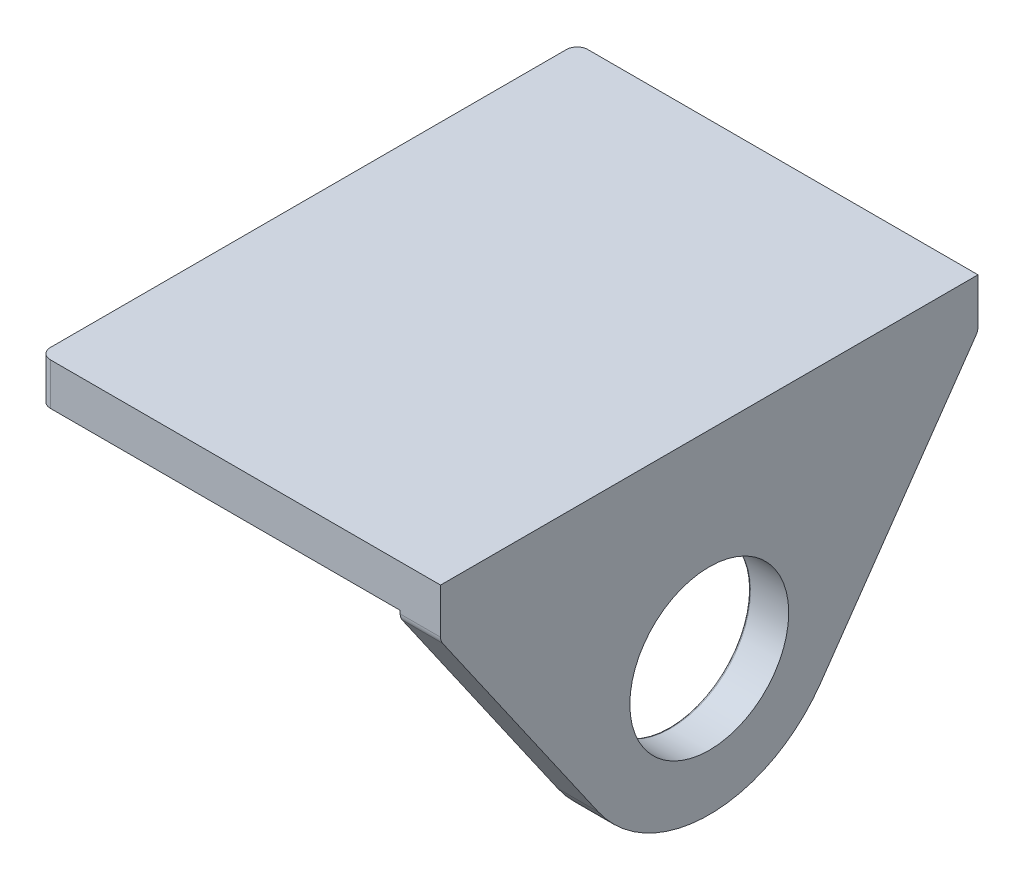
ISO-10303-21;
HEADER;
FILE_DESCRIPTION(('STEP AP214'),'2;1');
FILE_NAME('part.step','',(''),(''),'','','');
FILE_SCHEMA(('AUTOMOTIVE_DESIGN { 1 0 10303 214 1 1 1 1 }'));
ENDSEC;
DATA;
#1=APPLICATION_CONTEXT('core data for automotive mechanical design processes');
#2=APPLICATION_PROTOCOL_DEFINITION('international standard','automotive_design',2000,#1);
#3=PRODUCT_CONTEXT('',#1,'mechanical');
#4=PRODUCT('Part','Part','',(#3));
#5=PRODUCT_RELATED_PRODUCT_CATEGORY('part','',(#4));
#6=PRODUCT_DEFINITION_FORMATION('','',#4);
#7=PRODUCT_DEFINITION_CONTEXT('part definition',#1,'design');
#8=PRODUCT_DEFINITION('design','',#6,#7);
#9=PRODUCT_DEFINITION_SHAPE('','',#8);
#10=(LENGTH_UNIT() NAMED_UNIT(*) SI_UNIT(.MILLI.,.METRE.));
#11=(NAMED_UNIT(*) PLANE_ANGLE_UNIT() SI_UNIT($,.RADIAN.));
#12=(NAMED_UNIT(*) SI_UNIT($,.STERADIAN.) SOLID_ANGLE_UNIT());
#13=UNCERTAINTY_MEASURE_WITH_UNIT(LENGTH_MEASURE(1.E-05),#10,'distance_accuracy_value','');
#14=(GEOMETRIC_REPRESENTATION_CONTEXT(3) GLOBAL_UNCERTAINTY_ASSIGNED_CONTEXT((#13)) GLOBAL_UNIT_ASSIGNED_CONTEXT((#10,
#11,#12)) REPRESENTATION_CONTEXT('',''));
#15=CARTESIAN_POINT('',(0.,0.,0.));
#16=DIRECTION('',(0.,0.,1.));
#17=DIRECTION('',(1.,0.,0.));
#18=AXIS2_PLACEMENT_3D('',#15,#16,#17);
#19=CARTESIAN_POINT('',(47.4218,4.9784,0.));
#20=DIRECTION('',(-1.,0.,0.));
#21=DIRECTION('',(0.,0.,1.));
#22=AXIS2_PLACEMENT_3D('',#19,#20,#21);
#23=PLANE('',#22);
#24=CARTESIAN_POINT('',(47.4218,-18.4404,-31.7881));
#25=DIRECTION('',(-1.,0.,0.));
#26=DIRECTION('',(0.,0.,1.));
#27=AXIS2_PLACEMENT_3D('',#24,#25,#26);
#28=CIRCLE('',#27,9.398);
#29=CARTESIAN_POINT('',(47.4218,-18.4404,-22.3901));
#30=VERTEX_POINT('',#29);
#31=EDGE_CURVE('E177',#30,#30,#28,.T.);
#32=ORIENTED_EDGE('',*,*,#31,.T.);
#33=EDGE_LOOP('',(#32));
#34=FACE_BOUND('',#33,.T.);
#35=DIRECTION('',(0.,-0.820948727634145,0.571001914704214));
#36=VECTOR('',#35,1.);
#37=CARTESIAN_POINT('',(47.4218,-30.0506339262129,-43.2048107914022));
#38=LINE('',#37,#36);
#39=CARTESIAN_POINT('',(47.4218,-1.08893363413472,-63.3488048840954));
#40=VERTEX_POINT('',#39);
#41=CARTESIAN_POINT('',(47.4218,-27.5775726390968,-44.9249215396016));
#42=VERTEX_POINT('',#41);
#43=EDGE_CURVE('E166',#40,#42,#38,.T.);
#44=ORIENTED_EDGE('',*,*,#43,.F.);
#45=CARTESIAN_POINT('',(47.4218,-0.363761202460369,-62.3062));
#46=DIRECTION('',(-1.,0.,0.));
#47=DIRECTION('',(0.,0.,1.));
#48=AXIS2_PLACEMENT_3D('',#45,#46,#47);
#49=CIRCLE('',#48,1.27);
#50=CARTESIAN_POINT('',(47.4218,-0.363761202460369,-63.5762));
#51=VERTEX_POINT('',#50);
#52=EDGE_CURVE('E232',#40,#51,#49,.F.);
#53=ORIENTED_EDGE('',*,*,#52,.T.);
#54=DIRECTION('',(0.,-1.,0.));
#55=VECTOR('',#54,1.);
#56=CARTESIAN_POINT('',(47.4218,4.9784,-63.5762));
#57=LINE('',#56,#55);
#58=CARTESIAN_POINT('',(47.4218,4.9784,-63.5762));
#59=VERTEX_POINT('',#58);
#60=EDGE_CURVE('E211',#59,#51,#57,.T.);
#61=ORIENTED_EDGE('',*,*,#60,.F.);
#62=DIRECTION('',(0.,0.,-1.));
#63=VECTOR('',#62,1.);
#64=CARTESIAN_POINT('',(47.4218,4.9784,0.));
#65=LINE('',#64,#63);
#66=CARTESIAN_POINT('',(47.4218,4.9784,0.));
#67=VERTEX_POINT('',#66);
#68=EDGE_CURVE('E207',#67,#59,#65,.T.);
#69=ORIENTED_EDGE('',*,*,#68,.F.);
#70=DIRECTION('',(0.,-1.,0.));
#71=VECTOR('',#70,1.);
#72=CARTESIAN_POINT('',(47.4218,4.9784,0.));
#73=LINE('',#72,#71);
#74=CARTESIAN_POINT('',(47.4218,-0.363761202460372,0.));
#75=VERTEX_POINT('',#74);
#76=EDGE_CURVE('E219',#67,#75,#73,.T.);
#77=ORIENTED_EDGE('',*,*,#76,.T.);
#78=CARTESIAN_POINT('',(47.4218,-0.363761202460372,-1.27));
#79=DIRECTION('',(-1.,0.,0.));
#80=DIRECTION('',(0.,0.,1.));
#81=AXIS2_PLACEMENT_3D('',#78,#79,#80);
#82=CIRCLE('',#81,1.27);
#83=CARTESIAN_POINT('',(47.4218,-1.08893363413472,-0.227395115904636));
#84=VERTEX_POINT('',#83);
#85=EDGE_CURVE('E230',#75,#84,#82,.F.);
#86=ORIENTED_EDGE('',*,*,#85,.T.);
#87=DIRECTION('',(0.,-0.820948727634145,-0.571001914704214));
#88=VECTOR('',#87,1.);
#89=CARTESIAN_POINT('',(47.4218,-0.248444908186059,0.357197631059056));
#90=LINE('',#89,#88);
#91=CARTESIAN_POINT('',(47.4218,-27.5775726390968,-18.6512784603984));
#92=VERTEX_POINT('',#91);
#93=EDGE_CURVE('E189',#84,#92,#90,.T.);
#94=ORIENTED_EDGE('',*,*,#93,.T.);
#95=CARTESIAN_POINT('',(47.4218,-18.4404,-31.7881));
#96=DIRECTION('',(-1.,0.,0.));
#97=DIRECTION('',(0.,0.,1.));
#98=AXIS2_PLACEMENT_3D('',#95,#96,#97);
#99=CIRCLE('',#98,16.002);
#100=EDGE_CURVE('E187',#42,#92,#99,.T.);
#101=ORIENTED_EDGE('',*,*,#100,.F.);
#102=EDGE_LOOP('',(#44,#53,#61,#69,#77,#86,#94,#101));
#103=FACE_BOUND('',#102,.T.);
#104=ADVANCED_FACE('F64',(#34,#103),#23,.F.);
#105=CARTESIAN_POINT('',(42.6466,-34.4424,0.));
#106=DIRECTION('',(1.,0.,0.));
#107=DIRECTION('',(0.,0.,-1.));
#108=AXIS2_PLACEMENT_3D('',#105,#106,#107);
#109=PLANE('',#108);
#110=CARTESIAN_POINT('',(42.6466,-18.4404,-31.7881));
#111=DIRECTION('',(1.,0.,0.));
#112=DIRECTION('',(0.,0.,-1.));
#113=AXIS2_PLACEMENT_3D('',#110,#111,#112);
#114=CIRCLE('',#113,9.652);
#115=CARTESIAN_POINT('',(42.6466,-18.4404,-41.4401));
#116=VERTEX_POINT('',#115);
#117=EDGE_CURVE('E12',#116,#116,#114,.T.);
#118=ORIENTED_EDGE('',*,*,#117,.T.);
#119=EDGE_LOOP('',(#118));
#120=FACE_BOUND('',#119,.T.);
#121=DIRECTION('',(0.,1.,0.));
#122=VECTOR('',#121,1.);
#123=CARTESIAN_POINT('',(42.6466,-34.4424,-63.5762));
#124=LINE('',#123,#122);
#125=CARTESIAN_POINT('',(42.6466,-0.363761202460372,-63.5762));
#126=VERTEX_POINT('',#125);
#127=CARTESIAN_POINT('',(42.6466,0.,-63.5762));
#128=VERTEX_POINT('',#127);
#129=EDGE_CURVE('E196',#126,#128,#124,.T.);
#130=ORIENTED_EDGE('',*,*,#129,.F.);
#131=CARTESIAN_POINT('',(42.6466,-0.36376120246037,-62.3062));
#132=DIRECTION('',(1.,0.,0.));
#133=DIRECTION('',(0.,0.,-1.));
#134=AXIS2_PLACEMENT_3D('',#131,#132,#133);
#135=CIRCLE('',#134,1.27);
#136=CARTESIAN_POINT('',(42.6466,-1.08893363413472,-63.3488048840954));
#137=VERTEX_POINT('',#136);
#138=EDGE_CURVE('E162',#126,#137,#135,.F.);
#139=ORIENTED_EDGE('',*,*,#138,.T.);
#140=DIRECTION('',(0.,-0.820948727634145,0.571001914704214));
#141=VECTOR('',#140,1.);
#142=CARTESIAN_POINT('',(42.6466,-30.0506339262129,-43.2048107914022));
#143=LINE('',#142,#141);
#144=CARTESIAN_POINT('',(42.6466,-27.5775726390968,-44.9249215396016));
#145=VERTEX_POINT('',#144);
#146=EDGE_CURVE('E156',#137,#145,#143,.T.);
#147=ORIENTED_EDGE('',*,*,#146,.T.);
#148=CARTESIAN_POINT('',(42.6466,-18.4404,-31.7881));
#149=DIRECTION('',(-1.,0.,0.));
#150=DIRECTION('',(0.,0.,1.));
#151=AXIS2_PLACEMENT_3D('',#148,#149,#150);
#152=CIRCLE('',#151,16.002);
#153=CARTESIAN_POINT('',(42.6466,-27.5775726390968,-18.6512784603984));
#154=VERTEX_POINT('',#153);
#155=EDGE_CURVE('E161',#145,#154,#152,.T.);
#156=ORIENTED_EDGE('',*,*,#155,.T.);
#157=DIRECTION('',(0.,-0.820948727634145,-0.571001914704214));
#158=VECTOR('',#157,1.);
#159=CARTESIAN_POINT('',(42.6466,-0.248444908186059,0.357197631059056));
#160=LINE('',#159,#158);
#161=CARTESIAN_POINT('',(42.6466,-1.08893363413472,-0.227395115904636));
#162=VERTEX_POINT('',#161);
#163=EDGE_CURVE('E176',#162,#154,#160,.T.);
#164=ORIENTED_EDGE('',*,*,#163,.F.);
#165=CARTESIAN_POINT('',(42.6466,-0.363761202460372,-1.27));
#166=DIRECTION('',(1.,0.,0.));
#167=DIRECTION('',(0.,0.,-1.));
#168=AXIS2_PLACEMENT_3D('',#165,#166,#167);
#169=CIRCLE('',#168,1.27);
#170=CARTESIAN_POINT('',(42.6466,-0.363761202460372,0.));
#171=VERTEX_POINT('',#170);
#172=EDGE_CURVE('E225',#162,#171,#169,.F.);
#173=ORIENTED_EDGE('',*,*,#172,.T.);
#174=DIRECTION('',(0.,1.,0.));
#175=VECTOR('',#174,1.);
#176=CARTESIAN_POINT('',(42.6466,-34.4424,0.));
#177=LINE('',#176,#175);
#178=CARTESIAN_POINT('',(42.6466,0.,0.));
#179=VERTEX_POINT('',#178);
#180=EDGE_CURVE('E198',#171,#179,#177,.T.);
#181=ORIENTED_EDGE('',*,*,#180,.T.);
#182=DIRECTION('',(0.,0.,-1.));
#183=VECTOR('',#182,1.);
#184=CARTESIAN_POINT('',(42.6466,0.,0.));
#185=LINE('',#184,#183);
#186=EDGE_CURVE('E193',#179,#128,#185,.T.);
#187=ORIENTED_EDGE('',*,*,#186,.T.);
#188=EDGE_LOOP('',(#130,#139,#147,#156,#164,#173,#181,#187));
#189=FACE_BOUND('',#188,.T.);
#190=ADVANCED_FACE('F159',(#120,#189),#109,.F.);
#191=CARTESIAN_POINT('',(0.,4.9784,-63.5762));
#192=DIRECTION('',(0.,0.,1.));
#193=DIRECTION('',(1.,0.,0.));
#194=AXIS2_PLACEMENT_3D('',#191,#192,#193);
#195=PLANE('',#194);
#196=DIRECTION('',(-1.,0.,0.));
#197=VECTOR('',#196,1.);
#198=CARTESIAN_POINT('',(0.,0.,-63.5762));
#199=LINE('',#198,#197);
#200=CARTESIAN_POINT('',(1.27,0.,-63.5762));
#201=VERTEX_POINT('',#200);
#202=EDGE_CURVE('E205',#128,#201,#199,.T.);
#203=ORIENTED_EDGE('',*,*,#202,.T.);
#204=DIRECTION('',(0.,-1.,0.));
#205=VECTOR('',#204,1.);
#206=CARTESIAN_POINT('',(1.27,4.9784,-63.5762));
#207=LINE('',#206,#205);
#208=CARTESIAN_POINT('',(1.27,4.9784,-63.5762));
#209=VERTEX_POINT('',#208);
#210=EDGE_CURVE('E87',#201,#209,#207,.F.);
#211=ORIENTED_EDGE('',*,*,#210,.T.);
#212=DIRECTION('',(-1.,0.,0.));
#213=VECTOR('',#212,1.);
#214=CARTESIAN_POINT('',(0.,4.9784,-63.5762));
#215=LINE('',#214,#213);
#216=EDGE_CURVE('E209',#59,#209,#215,.T.);
#217=ORIENTED_EDGE('',*,*,#216,.F.);
#218=ORIENTED_EDGE('',*,*,#60,.T.);
#219=DIRECTION('',(-1.,0.,0.));
#220=VECTOR('',#219,1.);
#221=CARTESIAN_POINT('',(42.6466,-0.36376120246037,-63.5762));
#222=LINE('',#221,#220);
#223=EDGE_CURVE('E222',#51,#126,#222,.T.);
#224=ORIENTED_EDGE('',*,*,#223,.T.);
#225=ORIENTED_EDGE('',*,*,#129,.T.);
#226=EDGE_LOOP('',(#203,#211,#217,#218,#224,#225));
#227=FACE_BOUND('',#226,.T.);
#228=ADVANCED_FACE('F275',(#227),#195,.F.);
#229=CARTESIAN_POINT('',(0.,4.9784,0.));
#230=DIRECTION('',(1.,0.,0.));
#231=DIRECTION('',(0.,0.,-1.));
#232=AXIS2_PLACEMENT_3D('',#229,#230,#231);
#233=PLANE('',#232);
#234=DIRECTION('',(0.,0.,1.));
#235=VECTOR('',#234,1.);
#236=CARTESIAN_POINT('',(0.,4.9784,0.));
#237=LINE('',#236,#235);
#238=CARTESIAN_POINT('',(0.,4.9784,-62.3062));
#239=VERTEX_POINT('',#238);
#240=CARTESIAN_POINT('',(0.,4.9784,-1.27));
#241=VERTEX_POINT('',#240);
#242=EDGE_CURVE('E202',#239,#241,#237,.T.);
#243=ORIENTED_EDGE('',*,*,#242,.F.);
#244=DIRECTION('',(0.,-1.,0.));
#245=VECTOR('',#244,1.);
#246=CARTESIAN_POINT('',(0.,4.9784,-62.3062));
#247=LINE('',#246,#245);
#248=CARTESIAN_POINT('',(0.,0.,-62.3062));
#249=VERTEX_POINT('',#248);
#250=EDGE_CURVE('E241',#239,#249,#247,.T.);
#251=ORIENTED_EDGE('',*,*,#250,.T.);
#252=DIRECTION('',(0.,0.,1.));
#253=VECTOR('',#252,1.);
#254=CARTESIAN_POINT('',(0.,0.,0.));
#255=LINE('',#254,#253);
#256=CARTESIAN_POINT('',(0.,0.,-1.27));
#257=VERTEX_POINT('',#256);
#258=EDGE_CURVE('E201',#249,#257,#255,.T.);
#259=ORIENTED_EDGE('',*,*,#258,.T.);
#260=DIRECTION('',(0.,-1.,0.));
#261=VECTOR('',#260,1.);
#262=CARTESIAN_POINT('',(0.,4.9784,-1.27));
#263=LINE('',#262,#261);
#264=EDGE_CURVE('E239',#257,#241,#263,.F.);
#265=ORIENTED_EDGE('',*,*,#264,.T.);
#266=EDGE_LOOP('',(#243,#251,#259,#265));
#267=FACE_BOUND('',#266,.T.);
#268=ADVANCED_FACE('F286',(#267),#233,.F.);
#269=CARTESIAN_POINT('',(0.,4.9784,0.));
#270=DIRECTION('',(0.,0.,-1.));
#271=DIRECTION('',(-1.,0.,0.));
#272=AXIS2_PLACEMENT_3D('',#269,#270,#271);
#273=PLANE('',#272);
#274=DIRECTION('',(1.,0.,0.));
#275=VECTOR('',#274,1.);
#276=CARTESIAN_POINT('',(0.,4.9784,0.));
#277=LINE('',#276,#275);
#278=CARTESIAN_POINT('',(1.27,4.9784,0.));
#279=VERTEX_POINT('',#278);
#280=EDGE_CURVE('E204',#279,#67,#277,.T.);
#281=ORIENTED_EDGE('',*,*,#280,.F.);
#282=DIRECTION('',(0.,-1.,0.));
#283=VECTOR('',#282,1.);
#284=CARTESIAN_POINT('',(1.27,4.9784,0.));
#285=LINE('',#284,#283);
#286=CARTESIAN_POINT('',(1.27,0.,0.));
#287=VERTEX_POINT('',#286);
#288=EDGE_CURVE('E252',#279,#287,#285,.T.);
#289=ORIENTED_EDGE('',*,*,#288,.T.);
#290=DIRECTION('',(1.,0.,0.));
#291=VECTOR('',#290,1.);
#292=CARTESIAN_POINT('',(0.,0.,0.));
#293=LINE('',#292,#291);
#294=EDGE_CURVE('E214',#287,#179,#293,.T.);
#295=ORIENTED_EDGE('',*,*,#294,.T.);
#296=ORIENTED_EDGE('',*,*,#180,.F.);
#297=DIRECTION('',(-1.,0.,0.));
#298=VECTOR('',#297,1.);
#299=CARTESIAN_POINT('',(0.,-0.363761202460364,0.));
#300=LINE('',#299,#298);
#301=EDGE_CURVE('E237',#171,#75,#300,.F.);
#302=ORIENTED_EDGE('',*,*,#301,.T.);
#303=ORIENTED_EDGE('',*,*,#76,.F.);
#304=EDGE_LOOP('',(#281,#289,#295,#296,#302,#303));
#305=FACE_BOUND('',#304,.T.);
#306=ADVANCED_FACE('F282',(#305),#273,.F.);
#307=CARTESIAN_POINT('',(0.,4.9784,0.));
#308=DIRECTION('',(0.,-1.,0.));
#309=DIRECTION('',(0.,0.,-1.));
#310=AXIS2_PLACEMENT_3D('',#307,#308,#309);
#311=PLANE('',#310);
#312=ORIENTED_EDGE('',*,*,#216,.T.);
#313=CARTESIAN_POINT('',(1.27,4.9784,-62.3062));
#314=DIRECTION('',(0.,-1.,0.));
#315=DIRECTION('',(0.,0.,-1.));
#316=AXIS2_PLACEMENT_3D('',#313,#314,#315);
#317=CIRCLE('',#316,1.27);
#318=EDGE_CURVE('E250',#209,#239,#317,.F.);
#319=ORIENTED_EDGE('',*,*,#318,.T.);
#320=ORIENTED_EDGE('',*,*,#242,.T.);
#321=CARTESIAN_POINT('',(1.27,4.9784,-1.27));
#322=DIRECTION('',(0.,-1.,0.));
#323=DIRECTION('',(0.,0.,-1.));
#324=AXIS2_PLACEMENT_3D('',#321,#322,#323);
#325=CIRCLE('',#324,1.27);
#326=EDGE_CURVE('E79',#241,#279,#325,.F.);
#327=ORIENTED_EDGE('',*,*,#326,.T.);
#328=ORIENTED_EDGE('',*,*,#280,.T.);
#329=ORIENTED_EDGE('',*,*,#68,.T.);
#330=EDGE_LOOP('',(#312,#319,#320,#327,#328,#329));
#331=FACE_BOUND('',#330,.T.);
#332=ADVANCED_FACE('F285',(#331),#311,.F.);
#333=CARTESIAN_POINT('',(0.,0.,0.));
#334=DIRECTION('',(0.,-1.,0.));
#335=DIRECTION('',(0.,0.,-1.));
#336=AXIS2_PLACEMENT_3D('',#333,#334,#335);
#337=PLANE('',#336);
#338=ORIENTED_EDGE('',*,*,#258,.F.);
#339=CARTESIAN_POINT('',(1.27,0.,-62.3062));
#340=DIRECTION('',(0.,-1.,0.));
#341=DIRECTION('',(0.,0.,-1.));
#342=AXIS2_PLACEMENT_3D('',#339,#340,#341);
#343=CIRCLE('',#342,1.27);
#344=EDGE_CURVE('E246',#249,#201,#343,.T.);
#345=ORIENTED_EDGE('',*,*,#344,.T.);
#346=ORIENTED_EDGE('',*,*,#202,.F.);
#347=ORIENTED_EDGE('',*,*,#186,.F.);
#348=ORIENTED_EDGE('',*,*,#294,.F.);
#349=CARTESIAN_POINT('',(1.27,0.,-1.27));
#350=DIRECTION('',(0.,-1.,0.));
#351=DIRECTION('',(0.,0.,-1.));
#352=AXIS2_PLACEMENT_3D('',#349,#350,#351);
#353=CIRCLE('',#352,1.27);
#354=EDGE_CURVE('E244',#287,#257,#353,.T.);
#355=ORIENTED_EDGE('',*,*,#354,.T.);
#356=EDGE_LOOP('',(#338,#345,#346,#347,#348,#355));
#357=FACE_BOUND('',#356,.T.);
#358=ADVANCED_FACE('F314',(#357),#337,.T.);
#359=CARTESIAN_POINT('',(47.4218,-18.4404,-31.7881));
#360=DIRECTION('',(-1.,0.,0.));
#361=DIRECTION('',(0.,0.,1.));
#362=AXIS2_PLACEMENT_3D('',#359,#360,#361);
#363=CYLINDRICAL_SURFACE('',#362,16.002);
#364=ORIENTED_EDGE('',*,*,#155,.F.);
#365=DIRECTION('',(-1.,0.,0.));
#366=VECTOR('',#365,1.);
#367=CARTESIAN_POINT('',(47.4218,-27.5775726390968,-44.9249215396016));
#368=LINE('',#367,#366);
#369=EDGE_CURVE('E167',#42,#145,#368,.T.);
#370=ORIENTED_EDGE('',*,*,#369,.F.);
#371=ORIENTED_EDGE('',*,*,#100,.T.);
#372=DIRECTION('',(-1.,0.,0.));
#373=VECTOR('',#372,1.);
#374=CARTESIAN_POINT('',(47.4218,-27.5775726390968,-18.6512784603984));
#375=LINE('',#374,#373);
#376=EDGE_CURVE('E175',#92,#154,#375,.T.);
#377=ORIENTED_EDGE('',*,*,#376,.T.);
#378=EDGE_LOOP('',(#364,#370,#371,#377));
#379=FACE_BOUND('',#378,.T.);
#380=ADVANCED_FACE('F172',(#379),#363,.T.);
#381=CARTESIAN_POINT('',(47.4218,-0.248444908186059,0.357197631059056));
#382=DIRECTION('',(0.,0.571001914704214,-0.820948727634145));
#383=DIRECTION('',(0.,0.820948727634145,0.571001914704214));
#384=AXIS2_PLACEMENT_3D('',#381,#382,#383);
#385=PLANE('',#384);
#386=ORIENTED_EDGE('',*,*,#93,.F.);
#387=DIRECTION('',(-1.,0.,0.));
#388=VECTOR('',#387,1.);
#389=CARTESIAN_POINT('',(47.4218,-1.08893363413472,-0.227395115904636));
#390=LINE('',#389,#388);
#391=EDGE_CURVE('E234',#84,#162,#390,.T.);
#392=ORIENTED_EDGE('',*,*,#391,.T.);
#393=ORIENTED_EDGE('',*,*,#163,.T.);
#394=ORIENTED_EDGE('',*,*,#376,.F.);
#395=EDGE_LOOP('',(#386,#392,#393,#394));
#396=FACE_BOUND('',#395,.T.);
#397=ADVANCED_FACE('F322',(#396),#385,.F.);
#398=CARTESIAN_POINT('',(47.4218,-18.4404,-31.7881));
#399=DIRECTION('',(-1.,0.,0.));
#400=DIRECTION('',(0.,0.,1.));
#401=AXIS2_PLACEMENT_3D('',#398,#399,#400);
#402=CYLINDRICAL_SURFACE('',#401,9.398);
#403=CARTESIAN_POINT('',(42.9006,-18.4404,-31.7881));
#404=DIRECTION('',(1.,0.,0.));
#405=DIRECTION('',(0.,0.,-1.));
#406=AXIS2_PLACEMENT_3D('',#403,#404,#405);
#407=CIRCLE('',#406,9.398);
#408=CARTESIAN_POINT('',(42.9006,-18.4404,-41.1861));
#409=VERTEX_POINT('',#408);
#410=EDGE_CURVE('E72',#409,#409,#407,.F.);
#411=ORIENTED_EDGE('',*,*,#410,.T.);
#412=EDGE_LOOP('',(#411));
#413=FACE_BOUND('',#412,.T.);
#414=ORIENTED_EDGE('',*,*,#31,.F.);
#415=EDGE_LOOP('',(#414));
#416=FACE_BOUND('',#415,.T.);
#417=ADVANCED_FACE('F257',(#413,#416),#402,.F.);
#418=CARTESIAN_POINT('',(47.4218,-30.0506339262129,-43.2048107914022));
#419=DIRECTION('',(0.,-0.571001914704214,-0.820948727634145));
#420=DIRECTION('',(0.,0.820948727634145,-0.571001914704214));
#421=AXIS2_PLACEMENT_3D('',#418,#419,#420);
#422=PLANE('',#421);
#423=ORIENTED_EDGE('',*,*,#146,.F.);
#424=DIRECTION('',(-1.,0.,0.));
#425=VECTOR('',#424,1.);
#426=CARTESIAN_POINT('',(47.4218,-1.08893363413472,-63.3488048840954));
#427=LINE('',#426,#425);
#428=EDGE_CURVE('E228',#137,#40,#427,.F.);
#429=ORIENTED_EDGE('',*,*,#428,.T.);
#430=ORIENTED_EDGE('',*,*,#43,.T.);
#431=ORIENTED_EDGE('',*,*,#369,.T.);
#432=EDGE_LOOP('',(#423,#429,#430,#431));
#433=FACE_BOUND('',#432,.T.);
#434=ADVANCED_FACE('F179',(#433),#422,.T.);
#435=CARTESIAN_POINT('',(0.,-0.363761202460376,-62.3062));
#436=DIRECTION('',(1.,0.,0.));
#437=DIRECTION('',(0.,1.,0.));
#438=AXIS2_PLACEMENT_3D('',#435,#436,#437);
#439=CYLINDRICAL_SURFACE('',#438,1.27);
#440=ORIENTED_EDGE('',*,*,#52,.F.);
#441=ORIENTED_EDGE('',*,*,#428,.F.);
#442=ORIENTED_EDGE('',*,*,#138,.F.);
#443=ORIENTED_EDGE('',*,*,#223,.F.);
#444=EDGE_LOOP('',(#440,#441,#442,#443));
#445=FACE_BOUND('',#444,.T.);
#446=ADVANCED_FACE('F291',(#445),#439,.T.);
#447=CARTESIAN_POINT('',(47.4218,-0.363761202460372,-1.27));
#448=DIRECTION('',(-1.,0.,0.));
#449=DIRECTION('',(0.,-1.,0.));
#450=AXIS2_PLACEMENT_3D('',#447,#448,#449);
#451=CYLINDRICAL_SURFACE('',#450,1.27);
#452=ORIENTED_EDGE('',*,*,#85,.F.);
#453=ORIENTED_EDGE('',*,*,#301,.F.);
#454=ORIENTED_EDGE('',*,*,#172,.F.);
#455=ORIENTED_EDGE('',*,*,#391,.F.);
#456=EDGE_LOOP('',(#452,#453,#454,#455));
#457=FACE_BOUND('',#456,.T.);
#458=ADVANCED_FACE('F294',(#457),#451,.T.);
#459=CARTESIAN_POINT('',(1.27,4.9784,-62.3062));
#460=DIRECTION('',(0.,-1.,0.));
#461=DIRECTION('',(0.,0.,-1.));
#462=AXIS2_PLACEMENT_3D('',#459,#460,#461);
#463=CYLINDRICAL_SURFACE('',#462,1.27);
#464=ORIENTED_EDGE('',*,*,#318,.F.);
#465=ORIENTED_EDGE('',*,*,#210,.F.);
#466=ORIENTED_EDGE('',*,*,#344,.F.);
#467=ORIENTED_EDGE('',*,*,#250,.F.);
#468=EDGE_LOOP('',(#464,#465,#466,#467));
#469=FACE_BOUND('',#468,.T.);
#470=ADVANCED_FACE('F266',(#469),#463,.T.);
#471=CARTESIAN_POINT('',(1.27,4.9784,-1.27));
#472=DIRECTION('',(0.,-1.,0.));
#473=DIRECTION('',(0.,0.,-1.));
#474=AXIS2_PLACEMENT_3D('',#471,#472,#473);
#475=CYLINDRICAL_SURFACE('',#474,1.27);
#476=ORIENTED_EDGE('',*,*,#326,.F.);
#477=ORIENTED_EDGE('',*,*,#264,.F.);
#478=ORIENTED_EDGE('',*,*,#354,.F.);
#479=ORIENTED_EDGE('',*,*,#288,.F.);
#480=EDGE_LOOP('',(#476,#477,#478,#479));
#481=FACE_BOUND('',#480,.T.);
#482=ADVANCED_FACE('F261',(#481),#475,.T.);
#483=CARTESIAN_POINT('',(42.9006,-18.4404,-31.7881));
#484=DIRECTION('',(1.,0.,0.));
#485=DIRECTION('',(0.,0.,-1.));
#486=AXIS2_PLACEMENT_3D('',#483,#484,#485);
#487=TOROIDAL_SURFACE('',#486,9.652,0.254);
#488=ORIENTED_EDGE('',*,*,#117,.F.);
#489=EDGE_LOOP('',(#488));
#490=FACE_BOUND('',#489,.T.);
#491=ORIENTED_EDGE('',*,*,#410,.F.);
#492=EDGE_LOOP('',(#491));
#493=FACE_BOUND('',#492,.T.);
#494=ADVANCED_FACE('F66',(#490,#493),#487,.T.);
#495=CLOSED_SHELL('',(#104,#190,#228,#268,#306,#332,#358,#380,#397,#417,#434,#446,#458,#470,
#482,#494));
#496=MANIFOLD_SOLID_BREP('B2',#495);
#497=ADVANCED_BREP_SHAPE_REPRESENTATION('',(#18,#496),#14);
#498=SHAPE_DEFINITION_REPRESENTATION(#9,#497);
ENDSEC;
END-ISO-10303-21;
